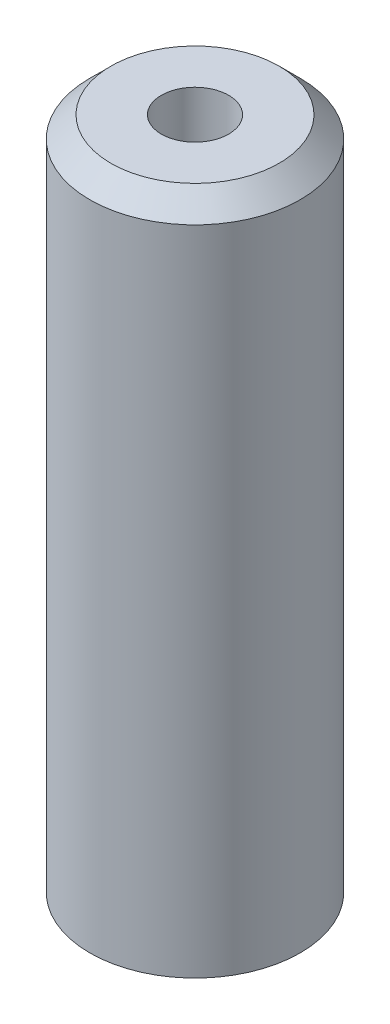
ISO-10303-21;
HEADER;
FILE_DESCRIPTION(('STEP AP214'),'2;1');
FILE_NAME('part.step','',(''),(''),'','','');
FILE_SCHEMA(('AUTOMOTIVE_DESIGN { 1 0 10303 214 1 1 1 1 }'));
ENDSEC;
DATA;
#1=APPLICATION_CONTEXT('core data for automotive mechanical design processes');
#2=APPLICATION_PROTOCOL_DEFINITION('international standard','automotive_design',2000,#1);
#3=PRODUCT_CONTEXT('',#1,'mechanical');
#4=PRODUCT('Part','Part','',(#3));
#5=PRODUCT_RELATED_PRODUCT_CATEGORY('part','',(#4));
#6=PRODUCT_DEFINITION_FORMATION('','',#4);
#7=PRODUCT_DEFINITION_CONTEXT('part definition',#1,'design');
#8=PRODUCT_DEFINITION('design','',#6,#7);
#9=PRODUCT_DEFINITION_SHAPE('','',#8);
#10=(LENGTH_UNIT() NAMED_UNIT(*) SI_UNIT(.MILLI.,.METRE.));
#11=(NAMED_UNIT(*) PLANE_ANGLE_UNIT() SI_UNIT($,.RADIAN.));
#12=(NAMED_UNIT(*) SI_UNIT($,.STERADIAN.) SOLID_ANGLE_UNIT());
#13=UNCERTAINTY_MEASURE_WITH_UNIT(LENGTH_MEASURE(1.E-05),#10,'distance_accuracy_value','');
#14=(GEOMETRIC_REPRESENTATION_CONTEXT(3) GLOBAL_UNCERTAINTY_ASSIGNED_CONTEXT((#13)) GLOBAL_UNIT_ASSIGNED_CONTEXT((#10,
#11,#12)) REPRESENTATION_CONTEXT('',''));
#15=CARTESIAN_POINT('',(0.,0.,0.));
#16=DIRECTION('',(0.,0.,1.));
#17=DIRECTION('',(1.,0.,0.));
#18=AXIS2_PLACEMENT_3D('',#15,#16,#17);
#19=CARTESIAN_POINT('',(0.,-10.,0.));
#20=DIRECTION('',(0.,1.,0.));
#21=DIRECTION('',(0.,0.,1.));
#22=AXIS2_PLACEMENT_3D('',#19,#20,#21);
#23=CYLINDRICAL_SURFACE('',#22,2.5);
#24=CARTESIAN_POINT('',(0.,5.5,0.));
#25=DIRECTION('',(0.,1.,0.));
#26=DIRECTION('',(0.,0.,1.));
#27=AXIS2_PLACEMENT_3D('',#24,#25,#26);
#28=CIRCLE('',#27,2.5);
#29=CARTESIAN_POINT('',(0.,5.5,2.5));
#30=VERTEX_POINT('',#29);
#31=EDGE_CURVE('E11',#30,#30,#28,.F.);
#32=ORIENTED_EDGE('',*,*,#31,.T.);
#33=EDGE_LOOP('',(#32));
#34=FACE_BOUND('',#33,.T.);
#35=CARTESIAN_POINT('',(0.,-10.,0.));
#36=DIRECTION('',(0.,1.,0.));
#37=DIRECTION('',(0.,0.,1.));
#38=AXIS2_PLACEMENT_3D('',#35,#36,#37);
#39=CIRCLE('',#38,2.5);
#40=CARTESIAN_POINT('',(0.,-10.,2.5));
#41=VERTEX_POINT('',#40);
#42=EDGE_CURVE('E56',#41,#41,#39,.T.);
#43=ORIENTED_EDGE('',*,*,#42,.T.);
#44=EDGE_LOOP('',(#43));
#45=FACE_BOUND('',#44,.T.);
#46=ADVANCED_FACE('F36',(#34,#45),#23,.T.);
#47=CARTESIAN_POINT('',(0.,-10.,0.));
#48=DIRECTION('',(0.,1.,0.));
#49=DIRECTION('',(0.,0.,1.));
#50=AXIS2_PLACEMENT_3D('',#47,#48,#49);
#51=PLANE('',#50);
#52=ORIENTED_EDGE('',*,*,#42,.F.);
#53=EDGE_LOOP('',(#52));
#54=FACE_BOUND('',#53,.T.);
#55=ADVANCED_FACE('F76',(#54),#51,.F.);
#56=CARTESIAN_POINT('',(0.,6.,0.));
#57=DIRECTION('',(0.,1.,0.));
#58=DIRECTION('',(0.,0.,1.));
#59=AXIS2_PLACEMENT_3D('',#56,#57,#58);
#60=PLANE('',#59);
#61=CARTESIAN_POINT('',(0.,6.,0.));
#62=DIRECTION('',(0.,1.,0.));
#63=DIRECTION('',(0.,0.,1.));
#64=AXIS2_PLACEMENT_3D('',#61,#62,#63);
#65=CIRCLE('',#64,2.);
#66=CARTESIAN_POINT('',(0.,6.,2.));
#67=VERTEX_POINT('',#66);
#68=EDGE_CURVE('E43',#67,#67,#65,.T.);
#69=ORIENTED_EDGE('',*,*,#68,.T.);
#70=EDGE_LOOP('',(#69));
#71=FACE_BOUND('',#70,.T.);
#72=CARTESIAN_POINT('',(0.,6.,0.));
#73=DIRECTION('',(0.,1.,0.));
#74=DIRECTION('',(0.,0.,1.));
#75=AXIS2_PLACEMENT_3D('',#72,#73,#74);
#76=CIRCLE('',#75,0.799999999999999);
#77=CARTESIAN_POINT('',(0.,6.,0.799999999999999));
#78=VERTEX_POINT('',#77);
#79=EDGE_CURVE('E57',#78,#78,#76,.T.);
#80=ORIENTED_EDGE('',*,*,#79,.F.);
#81=EDGE_LOOP('',(#80));
#82=FACE_BOUND('',#81,.T.);
#83=ADVANCED_FACE('F50',(#71,#82),#60,.T.);
#84=CARTESIAN_POINT('',(0.,0.,0.));
#85=DIRECTION('',(0.,1.,0.));
#86=DIRECTION('',(0.,0.,1.));
#87=AXIS2_PLACEMENT_3D('',#84,#85,#86);
#88=CONICAL_SURFACE('',#87,0.799999999999999,1.02974425867665);
#89=CARTESIAN_POINT('',(0.,-0.480688495222049,0.));
#90=VERTEX_POINT('',#89);
#91=VERTEX_LOOP('',#90);
#92=FACE_BOUND('',#91,.T.);
#93=CARTESIAN_POINT('',(0.,0.,0.));
#94=DIRECTION('',(0.,1.,0.));
#95=DIRECTION('',(0.,0.,1.));
#96=AXIS2_PLACEMENT_3D('',#93,#94,#95);
#97=CIRCLE('',#96,0.799999999999999);
#98=CARTESIAN_POINT('',(0.,0.,0.799999999999999));
#99=VERTEX_POINT('',#98);
#100=EDGE_CURVE('E54',#99,#99,#97,.T.);
#101=ORIENTED_EDGE('',*,*,#100,.T.);
#102=EDGE_LOOP('',(#101));
#103=FACE_BOUND('',#102,.T.);
#104=ADVANCED_FACE('F46',(#92,#103),#88,.F.);
#105=CARTESIAN_POINT('',(0.,6.,0.));
#106=DIRECTION('',(0.,1.,0.));
#107=DIRECTION('',(0.,0.,1.));
#108=AXIS2_PLACEMENT_3D('',#105,#106,#107);
#109=CYLINDRICAL_SURFACE('',#108,0.799999999999999);
#110=ORIENTED_EDGE('',*,*,#100,.F.);
#111=EDGE_LOOP('',(#110));
#112=FACE_BOUND('',#111,.T.);
#113=ORIENTED_EDGE('',*,*,#79,.T.);
#114=EDGE_LOOP('',(#113));
#115=FACE_BOUND('',#114,.T.);
#116=ADVANCED_FACE('F49',(#112,#115),#109,.F.);
#117=CARTESIAN_POINT('',(0.,6.,0.));
#118=DIRECTION('',(0.,-1.,0.));
#119=DIRECTION('',(0.,0.,-1.));
#120=AXIS2_PLACEMENT_3D('',#117,#118,#119);
#121=CONICAL_SURFACE('',#120,2.,0.785398163397446);
#122=ORIENTED_EDGE('',*,*,#31,.F.);
#123=EDGE_LOOP('',(#122));
#124=FACE_BOUND('',#123,.T.);
#125=ORIENTED_EDGE('',*,*,#68,.F.);
#126=EDGE_LOOP('',(#125));
#127=FACE_BOUND('',#126,.T.);
#128=ADVANCED_FACE('F38',(#124,#127),#121,.T.);
#129=CLOSED_SHELL('',(#46,#55,#83,#104,#116,#128));
#130=MANIFOLD_SOLID_BREP('B2',#129);
#131=ADVANCED_BREP_SHAPE_REPRESENTATION('',(#18,#130),#14);
#132=SHAPE_DEFINITION_REPRESENTATION(#9,#131);
ENDSEC;
END-ISO-10303-21;
